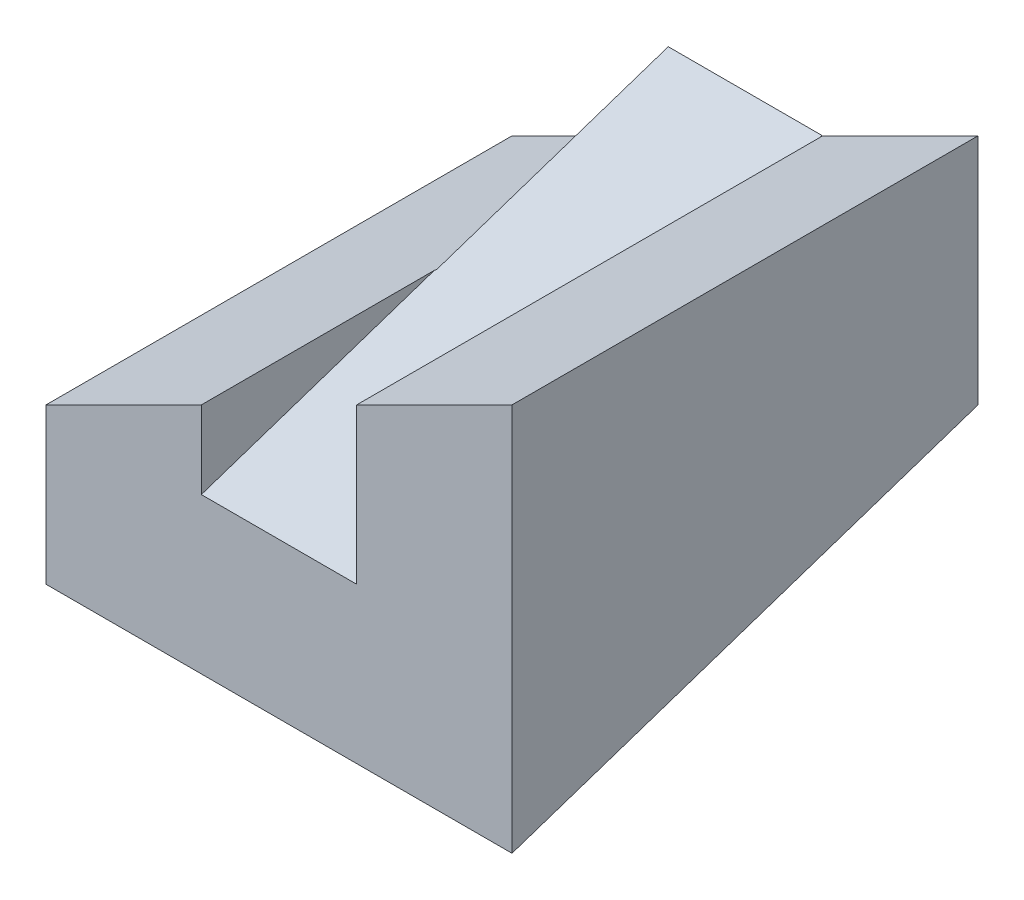
ISO-10303-21;
HEADER;
FILE_DESCRIPTION(('STEP AP214'),'2;1');
FILE_NAME('part.step','',(''),(''),'','','');
FILE_SCHEMA(('AUTOMOTIVE_DESIGN { 1 0 10303 214 1 1 1 1 }'));
ENDSEC;
DATA;
#1=APPLICATION_CONTEXT('core data for automotive mechanical design processes');
#2=APPLICATION_PROTOCOL_DEFINITION('international standard','automotive_design',2000,#1);
#3=PRODUCT_CONTEXT('',#1,'mechanical');
#4=PRODUCT('Part','Part','',(#3));
#5=PRODUCT_RELATED_PRODUCT_CATEGORY('part','',(#4));
#6=PRODUCT_DEFINITION_FORMATION('','',#4);
#7=PRODUCT_DEFINITION_CONTEXT('part definition',#1,'design');
#8=PRODUCT_DEFINITION('design','',#6,#7);
#9=PRODUCT_DEFINITION_SHAPE('','',#8);
#10=(LENGTH_UNIT() NAMED_UNIT(*) SI_UNIT(.MILLI.,.METRE.));
#11=(NAMED_UNIT(*) PLANE_ANGLE_UNIT() SI_UNIT($,.RADIAN.));
#12=(NAMED_UNIT(*) SI_UNIT($,.STERADIAN.) SOLID_ANGLE_UNIT());
#13=UNCERTAINTY_MEASURE_WITH_UNIT(LENGTH_MEASURE(1.E-05),#10,'distance_accuracy_value','');
#14=(GEOMETRIC_REPRESENTATION_CONTEXT(3) GLOBAL_UNCERTAINTY_ASSIGNED_CONTEXT((#13)) GLOBAL_UNIT_ASSIGNED_CONTEXT((#10,
#11,#12)) REPRESENTATION_CONTEXT('',''));
#15=CARTESIAN_POINT('',(0.,0.,0.));
#16=DIRECTION('',(0.,0.,1.));
#17=DIRECTION('',(1.,0.,0.));
#18=AXIS2_PLACEMENT_3D('',#15,#16,#17);
#19=CARTESIAN_POINT('',(3.,5.,3.));
#20=DIRECTION('',(-1.,0.,0.));
#21=DIRECTION('',(0.,0.,1.));
#22=AXIS2_PLACEMENT_3D('',#19,#20,#21);
#23=PLANE('',#22);
#24=DIRECTION('',(0.,0.316227766016838,-0.948683298050514));
#25=VECTOR('',#24,1.);
#26=CARTESIAN_POINT('',(3.,0.9,0.3));
#27=LINE('',#26,#25);
#28=CARTESIAN_POINT('',(3.,0.,3.));
#29=VERTEX_POINT('',#28);
#30=CARTESIAN_POINT('',(3.,2.,-3.));
#31=VERTEX_POINT('',#30);
#32=EDGE_CURVE('E216',#29,#31,#27,.T.);
#33=ORIENTED_EDGE('',*,*,#32,.T.);
#34=DIRECTION('',(0.,-1.,0.));
#35=VECTOR('',#34,1.);
#36=CARTESIAN_POINT('',(3.,5.,-3.));
#37=LINE('',#36,#35);
#38=CARTESIAN_POINT('',(3.,5.,-3.));
#39=VERTEX_POINT('',#38);
#40=EDGE_CURVE('E157',#39,#31,#37,.T.);
#41=ORIENTED_EDGE('',*,*,#40,.F.);
#42=DIRECTION('',(0.,0.,-1.));
#43=VECTOR('',#42,1.);
#44=CARTESIAN_POINT('',(3.,5.,3.));
#45=LINE('',#44,#43);
#46=CARTESIAN_POINT('',(3.,5.,3.));
#47=VERTEX_POINT('',#46);
#48=EDGE_CURVE('E147',#47,#39,#45,.T.);
#49=ORIENTED_EDGE('',*,*,#48,.F.);
#50=DIRECTION('',(0.,-1.,0.));
#51=VECTOR('',#50,1.);
#52=CARTESIAN_POINT('',(3.,5.,3.));
#53=LINE('',#52,#51);
#54=EDGE_CURVE('E150',#47,#29,#53,.T.);
#55=ORIENTED_EDGE('',*,*,#54,.T.);
#56=EDGE_LOOP('',(#33,#41,#49,#55));
#57=FACE_BOUND('',#56,.T.);
#58=ADVANCED_FACE('F33',(#57),#23,.F.);
#59=CARTESIAN_POINT('',(-3.,5.,-3.));
#60=DIRECTION('',(0.,0.,1.));
#61=DIRECTION('',(1.,0.,0.));
#62=AXIS2_PLACEMENT_3D('',#59,#60,#61);
#63=PLANE('',#62);
#64=DIRECTION('',(1.,0.,0.));
#65=VECTOR('',#64,1.);
#66=CARTESIAN_POINT('',(1.,2.,-3.));
#67=LINE('',#66,#65);
#68=CARTESIAN_POINT('',(1.,2.,-3.));
#69=VERTEX_POINT('',#68);
#70=EDGE_CURVE('E132',#69,#31,#67,.T.);
#71=ORIENTED_EDGE('',*,*,#70,.F.);
#72=DIRECTION('',(0.,1.,0.));
#73=VECTOR('',#72,1.);
#74=CARTESIAN_POINT('',(1.,0.,-3.));
#75=LINE('',#74,#73);
#76=CARTESIAN_POINT('',(1.,0.,-3.));
#77=VERTEX_POINT('',#76);
#78=EDGE_CURVE('E119',#77,#69,#75,.T.);
#79=ORIENTED_EDGE('',*,*,#78,.F.);
#80=DIRECTION('',(-1.,0.,0.));
#81=VECTOR('',#80,1.);
#82=CARTESIAN_POINT('',(-3.,0.,-3.));
#83=LINE('',#82,#81);
#84=CARTESIAN_POINT('',(-3.,0.,-3.));
#85=VERTEX_POINT('',#84);
#86=EDGE_CURVE('E129',#77,#85,#83,.T.);
#87=ORIENTED_EDGE('',*,*,#86,.T.);
#88=DIRECTION('',(0.,-1.,0.));
#89=VECTOR('',#88,1.);
#90=CARTESIAN_POINT('',(-3.,5.,-3.));
#91=LINE('',#90,#89);
#92=CARTESIAN_POINT('',(-3.,2.,-3.));
#93=VERTEX_POINT('',#92);
#94=EDGE_CURVE('E155',#93,#85,#91,.T.);
#95=ORIENTED_EDGE('',*,*,#94,.F.);
#96=DIRECTION('',(0.894427190999916,0.447213595499958,0.));
#97=VECTOR('',#96,1.);
#98=CARTESIAN_POINT('',(-1.8,2.6,-3.));
#99=LINE('',#98,#97);
#100=CARTESIAN_POINT('',(-0.988087329831461,3.00595633508427,-3.));
#101=VERTEX_POINT('',#100);
#102=EDGE_CURVE('E191',#93,#101,#99,.T.);
#103=ORIENTED_EDGE('',*,*,#102,.T.);
#104=DIRECTION('',(0.,1.,0.));
#105=VECTOR('',#104,1.);
#106=CARTESIAN_POINT('',(-0.988087329831461,5.,-3.));
#107=LINE('',#106,#105);
#108=CARTESIAN_POINT('',(-0.988087329831461,4.,-3.));
#109=VERTEX_POINT('',#108);
#110=EDGE_CURVE('E195',#101,#109,#107,.T.);
#111=ORIENTED_EDGE('',*,*,#110,.T.);
#112=DIRECTION('',(1.,0.,0.));
#113=VECTOR('',#112,1.);
#114=CARTESIAN_POINT('',(-3.,4.,-3.));
#115=LINE('',#114,#113);
#116=CARTESIAN_POINT('',(0.988087329831461,4.,-3.));
#117=VERTEX_POINT('',#116);
#118=EDGE_CURVE('E144',#109,#117,#115,.T.);
#119=ORIENTED_EDGE('',*,*,#118,.T.);
#120=DIRECTION('',(0.,1.,0.));
#121=VECTOR('',#120,1.);
#122=CARTESIAN_POINT('',(0.988087329831462,5.,-3.));
#123=LINE('',#122,#121);
#124=CARTESIAN_POINT('',(0.988087329831461,3.99404366491573,-3.));
#125=VERTEX_POINT('',#124);
#126=EDGE_CURVE('E139',#125,#117,#123,.T.);
#127=ORIENTED_EDGE('',*,*,#126,.F.);
#128=DIRECTION('',(0.894427190999916,0.447213595499958,0.));
#129=VECTOR('',#128,1.);
#130=CARTESIAN_POINT('',(-1.8,2.6,-3.));
#131=LINE('',#130,#129);
#132=CARTESIAN_POINT('',(1.,4.,-3.));
#133=VERTEX_POINT('',#132);
#134=EDGE_CURVE('E179',#125,#133,#131,.T.);
#135=ORIENTED_EDGE('',*,*,#134,.T.);
#136=EDGE_CURVE('E192',#133,#39,#131,.T.);
#137=ORIENTED_EDGE('',*,*,#136,.T.);
#138=ORIENTED_EDGE('',*,*,#40,.T.);
#139=EDGE_LOOP('',(#71,#79,#87,#95,#103,#111,#119,#127,#135,#137,#138));
#140=FACE_BOUND('',#139,.T.);
#141=ADVANCED_FACE('F127',(#140),#63,.F.);
#142=CARTESIAN_POINT('',(0.,0.,0.));
#143=DIRECTION('',(0.,-1.,0.));
#144=DIRECTION('',(0.,0.,-1.));
#145=AXIS2_PLACEMENT_3D('',#142,#143,#144);
#146=PLANE('',#145);
#147=ORIENTED_EDGE('',*,*,#86,.F.);
#148=DIRECTION('',(0.,0.,-1.));
#149=VECTOR('',#148,1.);
#150=CARTESIAN_POINT('',(1.,0.,0.));
#151=LINE('',#150,#149);
#152=CARTESIAN_POINT('',(1.,0.,3.));
#153=VERTEX_POINT('',#152);
#154=EDGE_CURVE('E116',#153,#77,#151,.T.);
#155=ORIENTED_EDGE('',*,*,#154,.F.);
#156=DIRECTION('',(1.,0.,0.));
#157=VECTOR('',#156,1.);
#158=CARTESIAN_POINT('',(-3.,0.,3.));
#159=LINE('',#158,#157);
#160=CARTESIAN_POINT('',(-3.,0.,3.));
#161=VERTEX_POINT('',#160);
#162=EDGE_CURVE('E141',#161,#153,#159,.T.);
#163=ORIENTED_EDGE('',*,*,#162,.F.);
#164=DIRECTION('',(0.,0.,1.));
#165=VECTOR('',#164,1.);
#166=CARTESIAN_POINT('',(-3.,0.,3.));
#167=LINE('',#166,#165);
#168=EDGE_CURVE('E138',#85,#161,#167,.T.);
#169=ORIENTED_EDGE('',*,*,#168,.F.);
#170=EDGE_LOOP('',(#147,#155,#163,#169));
#171=FACE_BOUND('',#170,.T.);
#172=ADVANCED_FACE('F136',(#171),#146,.T.);
#173=CARTESIAN_POINT('',(-3.,5.,3.));
#174=DIRECTION('',(0.,0.,-1.));
#175=DIRECTION('',(-1.,0.,0.));
#176=AXIS2_PLACEMENT_3D('',#173,#174,#175);
#177=PLANE('',#176);
#178=DIRECTION('',(0.,1.,0.));
#179=VECTOR('',#178,1.);
#180=CARTESIAN_POINT('',(-1.,0.,3.));
#181=LINE('',#180,#179);
#182=CARTESIAN_POINT('',(-1.,2.,3.));
#183=VERTEX_POINT('',#182);
#184=CARTESIAN_POINT('',(-1.,3.,3.));
#185=VERTEX_POINT('',#184);
#186=EDGE_CURVE('E226',#183,#185,#181,.T.);
#187=ORIENTED_EDGE('',*,*,#186,.T.);
#188=DIRECTION('',(0.894427190999916,0.447213595499958,0.));
#189=VECTOR('',#188,1.);
#190=CARTESIAN_POINT('',(-1.4,2.8,3.));
#191=LINE('',#190,#189);
#192=CARTESIAN_POINT('',(-3.,2.,3.));
#193=VERTEX_POINT('',#192);
#194=EDGE_CURVE('E181',#193,#185,#191,.T.);
#195=ORIENTED_EDGE('',*,*,#194,.F.);
#196=DIRECTION('',(0.,-1.,0.));
#197=VECTOR('',#196,1.);
#198=CARTESIAN_POINT('',(-3.,5.,3.));
#199=LINE('',#198,#197);
#200=EDGE_CURVE('E153',#193,#161,#199,.T.);
#201=ORIENTED_EDGE('',*,*,#200,.T.);
#202=ORIENTED_EDGE('',*,*,#162,.T.);
#203=DIRECTION('',(1.,0.,0.));
#204=VECTOR('',#203,1.);
#205=CARTESIAN_POINT('',(1.,0.,3.));
#206=LINE('',#205,#204);
#207=EDGE_CURVE('E133',#153,#29,#206,.T.);
#208=ORIENTED_EDGE('',*,*,#207,.T.);
#209=ORIENTED_EDGE('',*,*,#54,.F.);
#210=CARTESIAN_POINT('',(1.,4.,3.));
#211=VERTEX_POINT('',#210);
#212=EDGE_CURVE('E186',#211,#47,#191,.T.);
#213=ORIENTED_EDGE('',*,*,#212,.F.);
#214=DIRECTION('',(0.,1.,0.));
#215=VECTOR('',#214,1.);
#216=CARTESIAN_POINT('',(1.,0.,3.));
#217=LINE('',#216,#215);
#218=CARTESIAN_POINT('',(1.,2.,3.));
#219=VERTEX_POINT('',#218);
#220=EDGE_CURVE('E55',#219,#211,#217,.T.);
#221=ORIENTED_EDGE('',*,*,#220,.F.);
#222=DIRECTION('',(1.,0.,0.));
#223=VECTOR('',#222,1.);
#224=CARTESIAN_POINT('',(-1.,2.,3.));
#225=LINE('',#224,#223);
#226=EDGE_CURVE('E175',#183,#219,#225,.T.);
#227=ORIENTED_EDGE('',*,*,#226,.F.);
#228=EDGE_LOOP('',(#187,#195,#201,#202,#208,#209,#213,#221,#227));
#229=FACE_BOUND('',#228,.T.);
#230=ADVANCED_FACE('F238',(#229),#177,.F.);
#231=CARTESIAN_POINT('',(0.988087329831461,0.,-9.));
#232=DIRECTION('',(1.,0.,0.));
#233=DIRECTION('',(0.,0.,-1.));
#234=AXIS2_PLACEMENT_3D('',#231,#232,#233);
#235=PLANE('',#234);
#236=ORIENTED_EDGE('',*,*,#126,.T.);
#237=DIRECTION('',(0.,-0.316227766016838,0.948683298050514));
#238=VECTOR('',#237,1.);
#239=CARTESIAN_POINT('',(0.988087329831461,5.4,-7.2));
#240=LINE('',#239,#238);
#241=CARTESIAN_POINT('',(0.988087329831461,3.99404366491573,-2.98213099474719));
#242=VERTEX_POINT('',#241);
#243=EDGE_CURVE('E163',#117,#242,#240,.T.);
#244=ORIENTED_EDGE('',*,*,#243,.T.);
#245=DIRECTION('',(0.,0.,1.));
#246=VECTOR('',#245,1.);
#247=CARTESIAN_POINT('',(0.988087329831461,3.99404366491573,-9.));
#248=LINE('',#247,#246);
#249=EDGE_CURVE('E171',#125,#242,#248,.T.);
#250=ORIENTED_EDGE('',*,*,#249,.F.);
#251=EDGE_LOOP('',(#236,#244,#250));
#252=FACE_BOUND('',#251,.T.);
#253=ADVANCED_FACE('F170',(#252),#235,.T.);
#254=CARTESIAN_POINT('',(-0.988087329831461,0.,-9.));
#255=DIRECTION('',(1.,0.,0.));
#256=DIRECTION('',(0.,0.,-1.));
#257=AXIS2_PLACEMENT_3D('',#254,#255,#256);
#258=PLANE('',#257);
#259=DIRECTION('',(0.,-0.316227766016838,0.948683298050514));
#260=VECTOR('',#259,1.);
#261=CARTESIAN_POINT('',(-0.988087329831461,5.4,-7.2));
#262=LINE('',#261,#260);
#263=CARTESIAN_POINT('',(-0.988087329831462,3.00595633508427,-0.017869005252808));
#264=VERTEX_POINT('',#263);
#265=EDGE_CURVE('E199',#109,#264,#262,.T.);
#266=ORIENTED_EDGE('',*,*,#265,.F.);
#267=ORIENTED_EDGE('',*,*,#110,.F.);
#268=DIRECTION('',(0.,0.,1.));
#269=VECTOR('',#268,1.);
#270=CARTESIAN_POINT('',(-0.988087329831461,3.00595633508427,-9.));
#271=LINE('',#270,#269);
#272=EDGE_CURVE('E183',#101,#264,#271,.T.);
#273=ORIENTED_EDGE('',*,*,#272,.T.);
#274=EDGE_LOOP('',(#266,#267,#273));
#275=FACE_BOUND('',#274,.T.);
#276=ADVANCED_FACE('F203',(#275),#258,.F.);
#277=CARTESIAN_POINT('',(-1.4,2.8,-9.));
#278=DIRECTION('',(0.447213595499958,-0.894427190999916,0.));
#279=DIRECTION('',(0.894427190999916,0.447213595499958,0.));
#280=AXIS2_PLACEMENT_3D('',#277,#278,#279);
#281=PLANE('',#280);
#282=DIRECTION('',(-0.534522483824849,-0.267261241912424,0.801783725737273));
#283=VECTOR('',#282,1.);
#284=CARTESIAN_POINT('',(2.71428571428572,4.85714285714286,-5.57142857142857));
#285=LINE('',#284,#283);
#286=CARTESIAN_POINT('',(-1.,3.,0.));
#287=VERTEX_POINT('',#286);
#288=EDGE_CURVE('E174',#264,#287,#285,.T.);
#289=ORIENTED_EDGE('',*,*,#288,.F.);
#290=ORIENTED_EDGE('',*,*,#272,.F.);
#291=ORIENTED_EDGE('',*,*,#102,.F.);
#292=DIRECTION('',(0.,0.,1.));
#293=VECTOR('',#292,1.);
#294=CARTESIAN_POINT('',(-3.,2.,-9.));
#295=LINE('',#294,#293);
#296=EDGE_CURVE('E180',#93,#193,#295,.T.);
#297=ORIENTED_EDGE('',*,*,#296,.T.);
#298=ORIENTED_EDGE('',*,*,#194,.T.);
#299=DIRECTION('',(0.,0.,1.));
#300=VECTOR('',#299,1.);
#301=CARTESIAN_POINT('',(-1.,3.,-9.));
#302=LINE('',#301,#300);
#303=EDGE_CURVE('E11',#287,#185,#302,.T.);
#304=ORIENTED_EDGE('',*,*,#303,.F.);
#305=EDGE_LOOP('',(#289,#290,#291,#297,#298,#304));
#306=FACE_BOUND('',#305,.T.);
#307=ADVANCED_FACE('F266',(#306),#281,.F.);
#308=DIRECTION('',(-0.534522483824849,-0.267261241912424,0.801783725737273));
#309=VECTOR('',#308,1.);
#310=CARTESIAN_POINT('',(2.71428571428572,4.85714285714286,-5.57142857142857));
#311=LINE('',#310,#309);
#312=EDGE_CURVE('E40',#133,#242,#311,.T.);
#313=ORIENTED_EDGE('',*,*,#312,.F.);
#314=ORIENTED_EDGE('',*,*,#134,.F.);
#315=ORIENTED_EDGE('',*,*,#249,.T.);
#316=EDGE_LOOP('',(#313,#314,#315));
#317=FACE_BOUND('',#316,.T.);
#318=ADVANCED_FACE('F177',(#317),#281,.F.);
#319=CARTESIAN_POINT('',(-3.,5.,3.));
#320=DIRECTION('',(1.,0.,0.));
#321=DIRECTION('',(0.,0.,-1.));
#322=AXIS2_PLACEMENT_3D('',#319,#320,#321);
#323=PLANE('',#322);
#324=ORIENTED_EDGE('',*,*,#200,.F.);
#325=ORIENTED_EDGE('',*,*,#296,.F.);
#326=ORIENTED_EDGE('',*,*,#94,.T.);
#327=ORIENTED_EDGE('',*,*,#168,.T.);
#328=EDGE_LOOP('',(#324,#325,#326,#327));
#329=FACE_BOUND('',#328,.T.);
#330=ADVANCED_FACE('F258',(#329),#323,.F.);
#331=ORIENTED_EDGE('',*,*,#136,.F.);
#332=DIRECTION('',(0.,0.,-1.));
#333=VECTOR('',#332,1.);
#334=CARTESIAN_POINT('',(1.,4.,0.));
#335=LINE('',#334,#333);
#336=EDGE_CURVE('E230',#211,#133,#335,.T.);
#337=ORIENTED_EDGE('',*,*,#336,.F.);
#338=ORIENTED_EDGE('',*,*,#212,.T.);
#339=ORIENTED_EDGE('',*,*,#48,.T.);
#340=EDGE_LOOP('',(#331,#337,#338,#339));
#341=FACE_BOUND('',#340,.T.);
#342=ADVANCED_FACE('F211',(#341),#281,.F.);
#343=CARTESIAN_POINT('',(-1.,0.,0.));
#344=DIRECTION('',(1.,0.,0.));
#345=DIRECTION('',(0.,0.,-1.));
#346=AXIS2_PLACEMENT_3D('',#343,#344,#345);
#347=PLANE('',#346);
#348=ORIENTED_EDGE('',*,*,#303,.T.);
#349=ORIENTED_EDGE('',*,*,#186,.F.);
#350=DIRECTION('',(0.,-0.316227766016838,0.948683298050514));
#351=VECTOR('',#350,1.);
#352=CARTESIAN_POINT('',(-1.,2.7,0.9));
#353=LINE('',#352,#351);
#354=EDGE_CURVE('E224',#287,#183,#353,.T.);
#355=ORIENTED_EDGE('',*,*,#354,.F.);
#356=EDGE_LOOP('',(#348,#349,#355));
#357=FACE_BOUND('',#356,.T.);
#358=ADVANCED_FACE('F273',(#357),#347,.T.);
#359=CARTESIAN_POINT('',(-1.,2.7,0.9));
#360=DIRECTION('',(0.,0.948683298050514,0.316227766016838));
#361=DIRECTION('',(0.,-0.316227766016838,0.948683298050514));
#362=AXIS2_PLACEMENT_3D('',#359,#360,#361);
#363=PLANE('',#362);
#364=ORIENTED_EDGE('',*,*,#265,.T.);
#365=ORIENTED_EDGE('',*,*,#288,.T.);
#366=ORIENTED_EDGE('',*,*,#354,.T.);
#367=ORIENTED_EDGE('',*,*,#226,.T.);
#368=DIRECTION('',(0.,-0.316227766016838,0.948683298050514));
#369=VECTOR('',#368,1.);
#370=CARTESIAN_POINT('',(1.,2.7,0.9));
#371=LINE('',#370,#369);
#372=EDGE_CURVE('E164',#133,#219,#371,.T.);
#373=ORIENTED_EDGE('',*,*,#372,.F.);
#374=ORIENTED_EDGE('',*,*,#312,.T.);
#375=ORIENTED_EDGE('',*,*,#243,.F.);
#376=ORIENTED_EDGE('',*,*,#118,.F.);
#377=EDGE_LOOP('',(#364,#365,#366,#367,#373,#374,#375,#376));
#378=FACE_BOUND('',#377,.T.);
#379=ADVANCED_FACE('F162',(#378),#363,.T.);
#380=CARTESIAN_POINT('',(1.,0.,0.));
#381=DIRECTION('',(1.,0.,0.));
#382=DIRECTION('',(0.,0.,-1.));
#383=AXIS2_PLACEMENT_3D('',#380,#381,#382);
#384=PLANE('',#383);
#385=ORIENTED_EDGE('',*,*,#372,.T.);
#386=ORIENTED_EDGE('',*,*,#220,.T.);
#387=ORIENTED_EDGE('',*,*,#336,.T.);
#388=EDGE_LOOP('',(#385,#386,#387));
#389=FACE_BOUND('',#388,.T.);
#390=ADVANCED_FACE('F237',(#389),#384,.F.);
#391=CARTESIAN_POINT('',(1.,0.9,0.3));
#392=DIRECTION('',(0.,-0.948683298050514,-0.316227766016838));
#393=DIRECTION('',(0.,0.316227766016838,-0.948683298050514));
#394=AXIS2_PLACEMENT_3D('',#391,#392,#393);
#395=PLANE('',#394);
#396=ORIENTED_EDGE('',*,*,#32,.F.);
#397=ORIENTED_EDGE('',*,*,#207,.F.);
#398=DIRECTION('',(0.,0.316227766016838,-0.948683298050514));
#399=VECTOR('',#398,1.);
#400=CARTESIAN_POINT('',(1.,0.9,0.3));
#401=LINE('',#400,#399);
#402=EDGE_CURVE('E47',#153,#69,#401,.T.);
#403=ORIENTED_EDGE('',*,*,#402,.T.);
#404=ORIENTED_EDGE('',*,*,#70,.T.);
#405=EDGE_LOOP('',(#396,#397,#403,#404));
#406=FACE_BOUND('',#405,.T.);
#407=ADVANCED_FACE('F239',(#406),#395,.T.);
#408=CARTESIAN_POINT('',(1.,0.,0.));
#409=DIRECTION('',(1.,0.,0.));
#410=DIRECTION('',(0.,0.,-1.));
#411=AXIS2_PLACEMENT_3D('',#408,#409,#410);
#412=PLANE('',#411);
#413=ORIENTED_EDGE('',*,*,#402,.F.);
#414=ORIENTED_EDGE('',*,*,#154,.T.);
#415=ORIENTED_EDGE('',*,*,#78,.T.);
#416=EDGE_LOOP('',(#413,#414,#415));
#417=FACE_BOUND('',#416,.T.);
#418=ADVANCED_FACE('F118',(#417),#412,.T.);
#419=CLOSED_SHELL('',(#58,#141,#172,#230,#253,#276,#307,#318,#330,#342,#358,#379,#390,#407,#418));
#420=MANIFOLD_SOLID_BREP('B2',#419);
#421=ADVANCED_BREP_SHAPE_REPRESENTATION('',(#18,#420),#14);
#422=SHAPE_DEFINITION_REPRESENTATION(#9,#421);
ENDSEC;
END-ISO-10303-21;
